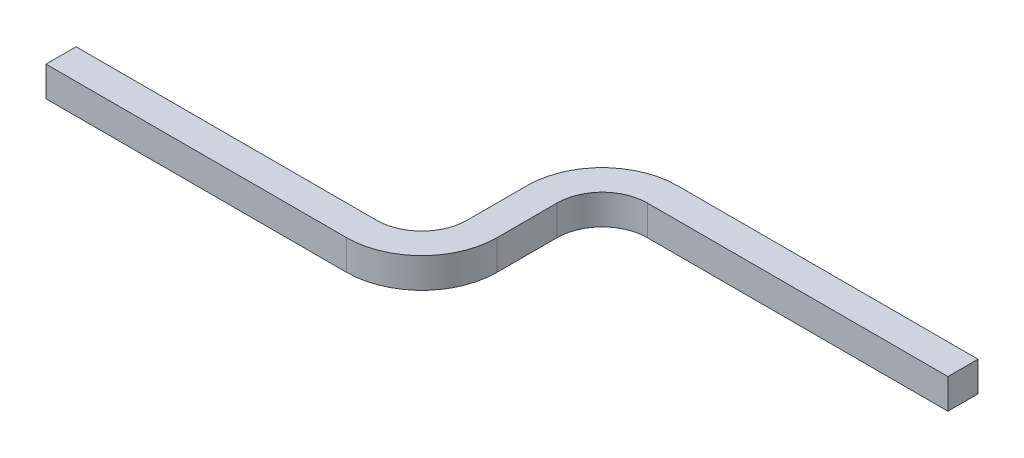
ISO-10303-21;
HEADER;
FILE_DESCRIPTION(('STEP AP214'),'2;1');
FILE_NAME('part.step','',(''),(''),'','','');
FILE_SCHEMA(('AUTOMOTIVE_DESIGN { 1 0 10303 214 1 1 1 1 }'));
ENDSEC;
DATA;
#1=APPLICATION_CONTEXT('core data for automotive mechanical design processes');
#2=APPLICATION_PROTOCOL_DEFINITION('international standard','automotive_design',2000,#1);
#3=PRODUCT_CONTEXT('',#1,'mechanical');
#4=PRODUCT('Part','Part','',(#3));
#5=PRODUCT_RELATED_PRODUCT_CATEGORY('part','',(#4));
#6=PRODUCT_DEFINITION_FORMATION('','',#4);
#7=PRODUCT_DEFINITION_CONTEXT('part definition',#1,'design');
#8=PRODUCT_DEFINITION('design','',#6,#7);
#9=PRODUCT_DEFINITION_SHAPE('','',#8);
#10=(LENGTH_UNIT() NAMED_UNIT(*) SI_UNIT(.MILLI.,.METRE.));
#11=(NAMED_UNIT(*) PLANE_ANGLE_UNIT() SI_UNIT($,.RADIAN.));
#12=(NAMED_UNIT(*) SI_UNIT($,.STERADIAN.) SOLID_ANGLE_UNIT());
#13=UNCERTAINTY_MEASURE_WITH_UNIT(LENGTH_MEASURE(1.E-05),#10,'distance_accuracy_value','');
#14=(GEOMETRIC_REPRESENTATION_CONTEXT(3) GLOBAL_UNCERTAINTY_ASSIGNED_CONTEXT((#13)) GLOBAL_UNIT_ASSIGNED_CONTEXT((#10,
#11,#12)) REPRESENTATION_CONTEXT('',''));
#15=CARTESIAN_POINT('',(0.,0.,0.));
#16=DIRECTION('',(0.,0.,1.));
#17=DIRECTION('',(1.,0.,0.));
#18=AXIS2_PLACEMENT_3D('',#15,#16,#17);
#19=CARTESIAN_POINT('',(140.,-5.,-64.9999999999999));
#20=DIRECTION('',(0.,0.,-1.));
#21=DIRECTION('',(-1.,0.,0.));
#22=AXIS2_PLACEMENT_3D('',#19,#20,#21);
#23=PLANE('',#22);
#24=DIRECTION('',(0.,1.,0.));
#25=VECTOR('',#24,1.);
#26=CARTESIAN_POINT('',(140.,-5.,-64.9999999999999));
#27=LINE('',#26,#25);
#28=CARTESIAN_POINT('',(140.,-5.,-64.9999999999999));
#29=VERTEX_POINT('',#28);
#30=CARTESIAN_POINT('',(140.,5.,-64.9999999999999));
#31=VERTEX_POINT('',#30);
#32=EDGE_CURVE('E185',#29,#31,#27,.T.);
#33=ORIENTED_EDGE('',*,*,#32,.T.);
#34=DIRECTION('',(1.,0.,0.));
#35=VECTOR('',#34,1.);
#36=CARTESIAN_POINT('',(140.,5.,-64.9999999999999));
#37=LINE('',#36,#35);
#38=CARTESIAN_POINT('',(240.,5.,-64.9999999999999));
#39=VERTEX_POINT('',#38);
#40=EDGE_CURVE('E210',#31,#39,#37,.T.);
#41=ORIENTED_EDGE('',*,*,#40,.T.);
#42=DIRECTION('',(0.,1.,0.));
#43=VECTOR('',#42,1.);
#44=CARTESIAN_POINT('',(240.,-5.,-64.9999999999999));
#45=LINE('',#44,#43);
#46=CARTESIAN_POINT('',(240.,-5.,-64.9999999999999));
#47=VERTEX_POINT('',#46);
#48=EDGE_CURVE('E55',#47,#39,#45,.T.);
#49=ORIENTED_EDGE('',*,*,#48,.F.);
#50=DIRECTION('',(1.,0.,0.));
#51=VECTOR('',#50,1.);
#52=CARTESIAN_POINT('',(140.,-5.,-64.9999999999999));
#53=LINE('',#52,#51);
#54=EDGE_CURVE('E40',#29,#47,#53,.T.);
#55=ORIENTED_EDGE('',*,*,#54,.F.);
#56=EDGE_LOOP('',(#33,#41,#49,#55));
#57=FACE_BOUND('',#56,.T.);
#58=ADVANCED_FACE('F33',(#57),#23,.T.);
#59=CARTESIAN_POINT('',(140.,-5.,-54.9999999999999));
#60=DIRECTION('',(0.,0.,1.));
#61=DIRECTION('',(1.,0.,0.));
#62=AXIS2_PLACEMENT_3D('',#59,#60,#61);
#63=PLANE('',#62);
#64=DIRECTION('',(0.,-1.,0.));
#65=VECTOR('',#64,1.);
#66=CARTESIAN_POINT('',(140.,-5.,-54.9999999999999));
#67=LINE('',#66,#65);
#68=CARTESIAN_POINT('',(140.,5.,-54.9999999999999));
#69=VERTEX_POINT('',#68);
#70=CARTESIAN_POINT('',(140.,-5.,-54.9999999999999));
#71=VERTEX_POINT('',#70);
#72=EDGE_CURVE('E182',#69,#71,#67,.T.);
#73=ORIENTED_EDGE('',*,*,#72,.T.);
#74=DIRECTION('',(1.,0.,0.));
#75=VECTOR('',#74,1.);
#76=CARTESIAN_POINT('',(140.,-5.,-54.9999999999999));
#77=LINE('',#76,#75);
#78=CARTESIAN_POINT('',(240.,-5.,-55.));
#79=VERTEX_POINT('',#78);
#80=EDGE_CURVE('E11',#71,#79,#77,.T.);
#81=ORIENTED_EDGE('',*,*,#80,.T.);
#82=DIRECTION('',(0.,-1.,0.));
#83=VECTOR('',#82,1.);
#84=CARTESIAN_POINT('',(240.,-5.,-55.));
#85=LINE('',#84,#83);
#86=CARTESIAN_POINT('',(240.,5.,-55.));
#87=VERTEX_POINT('',#86);
#88=EDGE_CURVE('E200',#87,#79,#85,.T.);
#89=ORIENTED_EDGE('',*,*,#88,.F.);
#90=DIRECTION('',(1.,0.,0.));
#91=VECTOR('',#90,1.);
#92=CARTESIAN_POINT('',(140.,5.,-54.9999999999999));
#93=LINE('',#92,#91);
#94=EDGE_CURVE('E207',#69,#87,#93,.T.);
#95=ORIENTED_EDGE('',*,*,#94,.F.);
#96=EDGE_LOOP('',(#73,#81,#89,#95));
#97=FACE_BOUND('',#96,.T.);
#98=ADVANCED_FACE('F220',(#97),#63,.T.);
#99=CARTESIAN_POINT('',(140.,0.,-40.));
#100=DIRECTION('',(0.,-1.,0.));
#101=DIRECTION('',(0.,0.,-1.));
#102=AXIS2_PLACEMENT_3D('',#99,#100,#101);
#103=CYLINDRICAL_SURFACE('',#102,25.);
#104=DIRECTION('',(0.,1.,0.));
#105=VECTOR('',#104,1.);
#106=CARTESIAN_POINT('',(115.,-5.,-40.));
#107=LINE('',#106,#105);
#108=CARTESIAN_POINT('',(115.,-5.,-40.));
#109=VERTEX_POINT('',#108);
#110=CARTESIAN_POINT('',(115.,5.,-40.));
#111=VERTEX_POINT('',#110);
#112=EDGE_CURVE('E169',#109,#111,#107,.T.);
#113=ORIENTED_EDGE('',*,*,#112,.T.);
#114=CARTESIAN_POINT('',(140.,5.,-40.));
#115=DIRECTION('',(0.,-1.,0.));
#116=DIRECTION('',(0.,0.,-1.));
#117=AXIS2_PLACEMENT_3D('',#114,#115,#116);
#118=CIRCLE('',#117,25.);
#119=EDGE_CURVE('E191',#111,#31,#118,.T.);
#120=ORIENTED_EDGE('',*,*,#119,.T.);
#121=ORIENTED_EDGE('',*,*,#32,.F.);
#122=CARTESIAN_POINT('',(140.,-5.,-40.));
#123=DIRECTION('',(0.,-1.,0.));
#124=DIRECTION('',(0.,0.,-1.));
#125=AXIS2_PLACEMENT_3D('',#122,#123,#124);
#126=CIRCLE('',#125,25.);
#127=EDGE_CURVE('E194',#109,#29,#126,.T.);
#128=ORIENTED_EDGE('',*,*,#127,.F.);
#129=EDGE_LOOP('',(#113,#120,#121,#128));
#130=FACE_BOUND('',#129,.T.);
#131=ADVANCED_FACE('F213',(#130),#103,.T.);
#132=CARTESIAN_POINT('',(140.,0.,-40.));
#133=DIRECTION('',(0.,-1.,0.));
#134=DIRECTION('',(0.,0.,-1.));
#135=AXIS2_PLACEMENT_3D('',#132,#133,#134);
#136=CYLINDRICAL_SURFACE('',#135,15.);
#137=DIRECTION('',(0.,-1.,0.));
#138=VECTOR('',#137,1.);
#139=CARTESIAN_POINT('',(125.,-5.,-40.));
#140=LINE('',#139,#138);
#141=CARTESIAN_POINT('',(125.,5.,-40.));
#142=VERTEX_POINT('',#141);
#143=CARTESIAN_POINT('',(125.,-5.,-40.));
#144=VERTEX_POINT('',#143);
#145=EDGE_CURVE('E132',#142,#144,#140,.T.);
#146=ORIENTED_EDGE('',*,*,#145,.T.);
#147=CARTESIAN_POINT('',(140.,-5.,-40.));
#148=DIRECTION('',(0.,-1.,0.));
#149=DIRECTION('',(0.,0.,-1.));
#150=AXIS2_PLACEMENT_3D('',#147,#148,#149);
#151=CIRCLE('',#150,15.);
#152=EDGE_CURVE('E197',#144,#71,#151,.T.);
#153=ORIENTED_EDGE('',*,*,#152,.T.);
#154=ORIENTED_EDGE('',*,*,#72,.F.);
#155=CARTESIAN_POINT('',(140.,5.,-40.));
#156=DIRECTION('',(0.,-1.,0.));
#157=DIRECTION('',(0.,0.,-1.));
#158=AXIS2_PLACEMENT_3D('',#155,#156,#157);
#159=CIRCLE('',#158,15.);
#160=EDGE_CURVE('E188',#142,#69,#159,.T.);
#161=ORIENTED_EDGE('',*,*,#160,.F.);
#162=EDGE_LOOP('',(#146,#153,#154,#161));
#163=FACE_BOUND('',#162,.T.);
#164=ADVANCED_FACE('F224',(#163),#136,.F.);
#165=CARTESIAN_POINT('',(115.,-5.,-20.));
#166=DIRECTION('',(-1.,0.,0.));
#167=DIRECTION('',(0.,0.,1.));
#168=AXIS2_PLACEMENT_3D('',#165,#166,#167);
#169=PLANE('',#168);
#170=DIRECTION('',(0.,1.,0.));
#171=VECTOR('',#170,1.);
#172=CARTESIAN_POINT('',(115.,-5.,-20.));
#173=LINE('',#172,#171);
#174=CARTESIAN_POINT('',(115.,-5.,-20.));
#175=VERTEX_POINT('',#174);
#176=CARTESIAN_POINT('',(115.,5.,-20.));
#177=VERTEX_POINT('',#176);
#178=EDGE_CURVE('E152',#175,#177,#173,.T.);
#179=ORIENTED_EDGE('',*,*,#178,.T.);
#180=DIRECTION('',(0.,0.,-1.));
#181=VECTOR('',#180,1.);
#182=CARTESIAN_POINT('',(115.,5.,-20.));
#183=LINE('',#182,#181);
#184=EDGE_CURVE('E175',#177,#111,#183,.T.);
#185=ORIENTED_EDGE('',*,*,#184,.T.);
#186=ORIENTED_EDGE('',*,*,#112,.F.);
#187=DIRECTION('',(0.,0.,-1.));
#188=VECTOR('',#187,1.);
#189=CARTESIAN_POINT('',(115.,-5.,-20.));
#190=LINE('',#189,#188);
#191=EDGE_CURVE('E178',#175,#109,#190,.T.);
#192=ORIENTED_EDGE('',*,*,#191,.F.);
#193=EDGE_LOOP('',(#179,#185,#186,#192));
#194=FACE_BOUND('',#193,.T.);
#195=ADVANCED_FACE('F265',(#194),#169,.T.);
#196=CARTESIAN_POINT('',(125.,-5.,-20.));
#197=DIRECTION('',(1.,0.,0.));
#198=DIRECTION('',(0.,0.,-1.));
#199=AXIS2_PLACEMENT_3D('',#196,#197,#198);
#200=PLANE('',#199);
#201=DIRECTION('',(0.,-1.,0.));
#202=VECTOR('',#201,1.);
#203=CARTESIAN_POINT('',(125.,-5.,-20.));
#204=LINE('',#203,#202);
#205=CARTESIAN_POINT('',(125.,5.,-20.));
#206=VERTEX_POINT('',#205);
#207=CARTESIAN_POINT('',(125.,-5.,-20.));
#208=VERTEX_POINT('',#207);
#209=EDGE_CURVE('E149',#206,#208,#204,.T.);
#210=ORIENTED_EDGE('',*,*,#209,.T.);
#211=DIRECTION('',(0.,0.,-1.));
#212=VECTOR('',#211,1.);
#213=CARTESIAN_POINT('',(125.,-5.,-20.));
#214=LINE('',#213,#212);
#215=EDGE_CURVE('E128',#208,#144,#214,.T.);
#216=ORIENTED_EDGE('',*,*,#215,.T.);
#217=ORIENTED_EDGE('',*,*,#145,.F.);
#218=DIRECTION('',(0.,0.,-1.));
#219=VECTOR('',#218,1.);
#220=CARTESIAN_POINT('',(125.,5.,-20.));
#221=LINE('',#220,#219);
#222=EDGE_CURVE('E172',#206,#142,#221,.T.);
#223=ORIENTED_EDGE('',*,*,#222,.F.);
#224=EDGE_LOOP('',(#210,#216,#217,#223));
#225=FACE_BOUND('',#224,.T.);
#226=ADVANCED_FACE('F226',(#225),#200,.T.);
#227=CARTESIAN_POINT('',(100.,0.,-20.));
#228=DIRECTION('',(0.,1.,0.));
#229=DIRECTION('',(0.,0.,1.));
#230=AXIS2_PLACEMENT_3D('',#227,#228,#229);
#231=CYLINDRICAL_SURFACE('',#230,15.);
#232=DIRECTION('',(0.,1.,0.));
#233=VECTOR('',#232,1.);
#234=CARTESIAN_POINT('',(100.,-5.,-5.));
#235=LINE('',#234,#233);
#236=CARTESIAN_POINT('',(100.,-5.,-5.));
#237=VERTEX_POINT('',#236);
#238=CARTESIAN_POINT('',(100.,5.,-5.));
#239=VERTEX_POINT('',#238);
#240=EDGE_CURVE('E143',#237,#239,#235,.T.);
#241=ORIENTED_EDGE('',*,*,#240,.T.);
#242=CARTESIAN_POINT('',(100.,5.,-20.));
#243=DIRECTION('',(0.,1.,0.));
#244=DIRECTION('',(0.,0.,1.));
#245=AXIS2_PLACEMENT_3D('',#242,#243,#244);
#246=CIRCLE('',#245,15.);
#247=EDGE_CURVE('E162',#239,#177,#246,.T.);
#248=ORIENTED_EDGE('',*,*,#247,.T.);
#249=ORIENTED_EDGE('',*,*,#178,.F.);
#250=CARTESIAN_POINT('',(100.,-5.,-20.));
#251=DIRECTION('',(0.,1.,0.));
#252=DIRECTION('',(0.,0.,1.));
#253=AXIS2_PLACEMENT_3D('',#250,#251,#252);
#254=CIRCLE('',#253,15.);
#255=EDGE_CURVE('E133',#237,#175,#254,.T.);
#256=ORIENTED_EDGE('',*,*,#255,.F.);
#257=EDGE_LOOP('',(#241,#248,#249,#256));
#258=FACE_BOUND('',#257,.T.);
#259=ADVANCED_FACE('F271',(#258),#231,.F.);
#260=CARTESIAN_POINT('',(100.,0.,-20.));
#261=DIRECTION('',(0.,1.,0.));
#262=DIRECTION('',(0.,0.,1.));
#263=AXIS2_PLACEMENT_3D('',#260,#261,#262);
#264=CYLINDRICAL_SURFACE('',#263,25.);
#265=DIRECTION('',(0.,-1.,0.));
#266=VECTOR('',#265,1.);
#267=CARTESIAN_POINT('',(100.,-5.,5.));
#268=LINE('',#267,#266);
#269=CARTESIAN_POINT('',(100.,5.,5.));
#270=VERTEX_POINT('',#269);
#271=CARTESIAN_POINT('',(100.,-5.,5.));
#272=VERTEX_POINT('',#271);
#273=EDGE_CURVE('E136',#270,#272,#268,.T.);
#274=ORIENTED_EDGE('',*,*,#273,.T.);
#275=CARTESIAN_POINT('',(100.,-5.,-20.));
#276=DIRECTION('',(0.,1.,0.));
#277=DIRECTION('',(0.,0.,1.));
#278=AXIS2_PLACEMENT_3D('',#275,#276,#277);
#279=CIRCLE('',#278,25.);
#280=EDGE_CURVE('E121',#272,#208,#279,.T.);
#281=ORIENTED_EDGE('',*,*,#280,.T.);
#282=ORIENTED_EDGE('',*,*,#209,.F.);
#283=CARTESIAN_POINT('',(100.,5.,-20.));
#284=DIRECTION('',(0.,1.,0.));
#285=DIRECTION('',(0.,0.,1.));
#286=AXIS2_PLACEMENT_3D('',#283,#284,#285);
#287=CIRCLE('',#286,25.);
#288=EDGE_CURVE('E139',#270,#206,#287,.T.);
#289=ORIENTED_EDGE('',*,*,#288,.F.);
#290=EDGE_LOOP('',(#274,#281,#282,#289));
#291=FACE_BOUND('',#290,.T.);
#292=ADVANCED_FACE('F137',(#291),#264,.T.);
#293=CARTESIAN_POINT('',(100.,-5.,5.));
#294=DIRECTION('',(0.,0.,-1.));
#295=DIRECTION('',(-1.,0.,0.));
#296=AXIS2_PLACEMENT_3D('',#293,#294,#295);
#297=PLANE('',#296);
#298=DIRECTION('',(0.,-1.,0.));
#299=VECTOR('',#298,1.);
#300=CARTESIAN_POINT('',(0.,-5.,5.));
#301=LINE('',#300,#299);
#302=CARTESIAN_POINT('',(0.,5.,5.));
#303=VERTEX_POINT('',#302);
#304=CARTESIAN_POINT('',(0.,-5.,5.));
#305=VERTEX_POINT('',#304);
#306=EDGE_CURVE('E148',#303,#305,#301,.T.);
#307=ORIENTED_EDGE('',*,*,#306,.T.);
#308=DIRECTION('',(-1.,0.,0.));
#309=VECTOR('',#308,1.);
#310=CARTESIAN_POINT('',(100.,-5.,5.));
#311=LINE('',#310,#309);
#312=EDGE_CURVE('E125',#272,#305,#311,.T.);
#313=ORIENTED_EDGE('',*,*,#312,.F.);
#314=ORIENTED_EDGE('',*,*,#273,.F.);
#315=DIRECTION('',(-1.,0.,0.));
#316=VECTOR('',#315,1.);
#317=CARTESIAN_POINT('',(100.,5.,5.));
#318=LINE('',#317,#316);
#319=EDGE_CURVE('E227',#270,#303,#318,.T.);
#320=ORIENTED_EDGE('',*,*,#319,.T.);
#321=EDGE_LOOP('',(#307,#313,#314,#320));
#322=FACE_BOUND('',#321,.T.);
#323=ADVANCED_FACE('F146',(#322),#297,.F.);
#324=CARTESIAN_POINT('',(100.,-5.,-5.));
#325=DIRECTION('',(0.,1.,0.));
#326=DIRECTION('',(0.,0.,1.));
#327=AXIS2_PLACEMENT_3D('',#324,#325,#326);
#328=PLANE('',#327);
#329=DIRECTION('',(0.,0.,-1.));
#330=VECTOR('',#329,1.);
#331=CARTESIAN_POINT('',(0.,-5.,-5.));
#332=LINE('',#331,#330);
#333=CARTESIAN_POINT('',(0.,-5.,-5.));
#334=VERTEX_POINT('',#333);
#335=EDGE_CURVE('E237',#305,#334,#332,.T.);
#336=ORIENTED_EDGE('',*,*,#335,.T.);
#337=DIRECTION('',(-1.,0.,0.));
#338=VECTOR('',#337,1.);
#339=CARTESIAN_POINT('',(100.,-5.,-5.));
#340=LINE('',#339,#338);
#341=EDGE_CURVE('E150',#237,#334,#340,.T.);
#342=ORIENTED_EDGE('',*,*,#341,.F.);
#343=ORIENTED_EDGE('',*,*,#255,.T.);
#344=ORIENTED_EDGE('',*,*,#191,.T.);
#345=ORIENTED_EDGE('',*,*,#127,.T.);
#346=ORIENTED_EDGE('',*,*,#54,.T.);
#347=DIRECTION('',(0.,0.,-1.));
#348=VECTOR('',#347,1.);
#349=CARTESIAN_POINT('',(240.,-5.,-64.9999999999999));
#350=LINE('',#349,#348);
#351=EDGE_CURVE('E47',#79,#47,#350,.T.);
#352=ORIENTED_EDGE('',*,*,#351,.F.);
#353=ORIENTED_EDGE('',*,*,#80,.F.);
#354=ORIENTED_EDGE('',*,*,#152,.F.);
#355=ORIENTED_EDGE('',*,*,#215,.F.);
#356=ORIENTED_EDGE('',*,*,#280,.F.);
#357=ORIENTED_EDGE('',*,*,#312,.T.);
#358=EDGE_LOOP('',(#336,#342,#343,#344,#345,#346,#352,#353,#354,#355,#356,#357));
#359=FACE_BOUND('',#358,.T.);
#360=ADVANCED_FACE('F123',(#359),#328,.F.);
#361=CARTESIAN_POINT('',(100.,-5.,-5.));
#362=DIRECTION('',(0.,0.,1.));
#363=DIRECTION('',(1.,0.,0.));
#364=AXIS2_PLACEMENT_3D('',#361,#362,#363);
#365=PLANE('',#364);
#366=DIRECTION('',(0.,1.,0.));
#367=VECTOR('',#366,1.);
#368=CARTESIAN_POINT('',(0.,-5.,-5.));
#369=LINE('',#368,#367);
#370=CARTESIAN_POINT('',(0.,5.,-5.));
#371=VERTEX_POINT('',#370);
#372=EDGE_CURVE('E235',#334,#371,#369,.T.);
#373=ORIENTED_EDGE('',*,*,#372,.T.);
#374=DIRECTION('',(-1.,0.,0.));
#375=VECTOR('',#374,1.);
#376=CARTESIAN_POINT('',(100.,5.,-5.));
#377=LINE('',#376,#375);
#378=EDGE_CURVE('E155',#239,#371,#377,.T.);
#379=ORIENTED_EDGE('',*,*,#378,.F.);
#380=ORIENTED_EDGE('',*,*,#240,.F.);
#381=ORIENTED_EDGE('',*,*,#341,.T.);
#382=EDGE_LOOP('',(#373,#379,#380,#381));
#383=FACE_BOUND('',#382,.T.);
#384=ADVANCED_FACE('F244',(#383),#365,.F.);
#385=CARTESIAN_POINT('',(100.,5.,-5.));
#386=DIRECTION('',(0.,-1.,0.));
#387=DIRECTION('',(0.,0.,-1.));
#388=AXIS2_PLACEMENT_3D('',#385,#386,#387);
#389=PLANE('',#388);
#390=DIRECTION('',(0.,0.,1.));
#391=VECTOR('',#390,1.);
#392=CARTESIAN_POINT('',(0.,5.,-5.));
#393=LINE('',#392,#391);
#394=EDGE_CURVE('E144',#371,#303,#393,.T.);
#395=ORIENTED_EDGE('',*,*,#394,.T.);
#396=ORIENTED_EDGE('',*,*,#319,.F.);
#397=ORIENTED_EDGE('',*,*,#288,.T.);
#398=ORIENTED_EDGE('',*,*,#222,.T.);
#399=ORIENTED_EDGE('',*,*,#160,.T.);
#400=ORIENTED_EDGE('',*,*,#94,.T.);
#401=DIRECTION('',(0.,0.,1.));
#402=VECTOR('',#401,1.);
#403=CARTESIAN_POINT('',(240.,5.,-64.9999999999999));
#404=LINE('',#403,#402);
#405=EDGE_CURVE('E202',#39,#87,#404,.T.);
#406=ORIENTED_EDGE('',*,*,#405,.F.);
#407=ORIENTED_EDGE('',*,*,#40,.F.);
#408=ORIENTED_EDGE('',*,*,#119,.F.);
#409=ORIENTED_EDGE('',*,*,#184,.F.);
#410=ORIENTED_EDGE('',*,*,#247,.F.);
#411=ORIENTED_EDGE('',*,*,#378,.T.);
#412=EDGE_LOOP('',(#395,#396,#397,#398,#399,#400,#406,#407,#408,#409,#410,#411));
#413=FACE_BOUND('',#412,.T.);
#414=ADVANCED_FACE('F216',(#413),#389,.F.);
#415=CARTESIAN_POINT('',(240.,0.,-60.));
#416=DIRECTION('',(1.,0.,0.));
#417=DIRECTION('',(0.,0.,-1.));
#418=AXIS2_PLACEMENT_3D('',#415,#416,#417);
#419=PLANE('',#418);
#420=ORIENTED_EDGE('',*,*,#88,.T.);
#421=ORIENTED_EDGE('',*,*,#351,.T.);
#422=ORIENTED_EDGE('',*,*,#48,.T.);
#423=ORIENTED_EDGE('',*,*,#405,.T.);
#424=EDGE_LOOP('',(#420,#421,#422,#423));
#425=FACE_BOUND('',#424,.T.);
#426=ADVANCED_FACE('F218',(#425),#419,.T.);
#427=CARTESIAN_POINT('',(0.,0.,0.));
#428=DIRECTION('',(1.,0.,0.));
#429=DIRECTION('',(0.,0.,-1.));
#430=AXIS2_PLACEMENT_3D('',#427,#428,#429);
#431=PLANE('',#430);
#432=ORIENTED_EDGE('',*,*,#306,.F.);
#433=ORIENTED_EDGE('',*,*,#394,.F.);
#434=ORIENTED_EDGE('',*,*,#372,.F.);
#435=ORIENTED_EDGE('',*,*,#335,.F.);
#436=EDGE_LOOP('',(#432,#433,#434,#435));
#437=FACE_BOUND('',#436,.T.);
#438=ADVANCED_FACE('F246',(#437),#431,.F.);
#439=CLOSED_SHELL('',(#58,#98,#131,#164,#195,#226,#259,#292,#323,#360,#384,#414,#426,#438));
#440=MANIFOLD_SOLID_BREP('B2',#439);
#441=ADVANCED_BREP_SHAPE_REPRESENTATION('',(#18,#440),#14);
#442=SHAPE_DEFINITION_REPRESENTATION(#9,#441);
ENDSEC;
END-ISO-10303-21;
